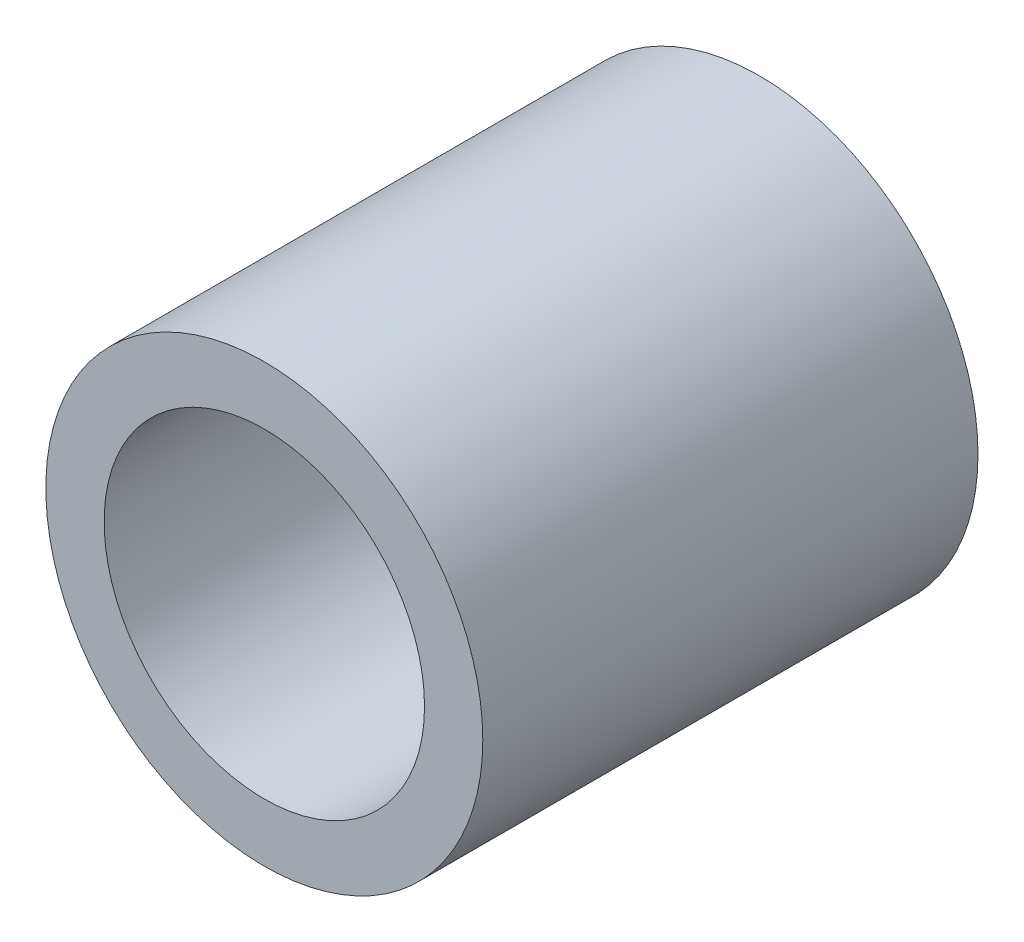
ISO-10303-21;
HEADER;
FILE_DESCRIPTION(('STEP AP214'),'2;1');
FILE_NAME('part.step','',(''),(''),'','','');
FILE_SCHEMA(('AUTOMOTIVE_DESIGN { 1 0 10303 214 1 1 1 1 }'));
ENDSEC;
DATA;
#1=APPLICATION_CONTEXT('core data for automotive mechanical design processes');
#2=APPLICATION_PROTOCOL_DEFINITION('international standard','automotive_design',2000,#1);
#3=PRODUCT_CONTEXT('',#1,'mechanical');
#4=PRODUCT('Part','Part','',(#3));
#5=PRODUCT_RELATED_PRODUCT_CATEGORY('part','',(#4));
#6=PRODUCT_DEFINITION_FORMATION('','',#4);
#7=PRODUCT_DEFINITION_CONTEXT('part definition',#1,'design');
#8=PRODUCT_DEFINITION('design','',#6,#7);
#9=PRODUCT_DEFINITION_SHAPE('','',#8);
#10=(LENGTH_UNIT() NAMED_UNIT(*) SI_UNIT(.MILLI.,.METRE.));
#11=(NAMED_UNIT(*) PLANE_ANGLE_UNIT() SI_UNIT($,.RADIAN.));
#12=(NAMED_UNIT(*) SI_UNIT($,.STERADIAN.) SOLID_ANGLE_UNIT());
#13=UNCERTAINTY_MEASURE_WITH_UNIT(LENGTH_MEASURE(1.E-05),#10,'distance_accuracy_value','');
#14=(GEOMETRIC_REPRESENTATION_CONTEXT(3) GLOBAL_UNCERTAINTY_ASSIGNED_CONTEXT((#13)) GLOBAL_UNIT_ASSIGNED_CONTEXT((#10,
#11,#12)) REPRESENTATION_CONTEXT('',''));
#15=CARTESIAN_POINT('',(0.,0.,0.));
#16=DIRECTION('',(0.,0.,1.));
#17=DIRECTION('',(1.,0.,0.));
#18=AXIS2_PLACEMENT_3D('',#15,#16,#17);
#19=CARTESIAN_POINT('',(0.,0.,34.544));
#20=DIRECTION('',(0.,0.,1.));
#21=DIRECTION('',(1.,0.,0.));
#22=AXIS2_PLACEMENT_3D('',#19,#20,#21);
#23=PLANE('',#22);
#24=CARTESIAN_POINT('',(0.,0.,34.544));
#25=DIRECTION('',(0.,0.,1.));
#26=DIRECTION('',(1.,0.,0.));
#27=AXIS2_PLACEMENT_3D('',#24,#25,#26);
#28=CIRCLE('',#27,15.24);
#29=CARTESIAN_POINT('',(15.24,0.,34.544));
#30=VERTEX_POINT('',#29);
#31=EDGE_CURVE('E10',#30,#30,#28,.T.);
#32=ORIENTED_EDGE('',*,*,#31,.T.);
#33=EDGE_LOOP('',(#32));
#34=FACE_BOUND('',#33,.T.);
#35=CARTESIAN_POINT('',(0.,0.,34.544));
#36=DIRECTION('',(0.,0.,1.));
#37=DIRECTION('',(1.,0.,0.));
#38=AXIS2_PLACEMENT_3D('',#35,#36,#37);
#39=CIRCLE('',#38,11.176);
#40=CARTESIAN_POINT('',(11.176,0.,34.544));
#41=VERTEX_POINT('',#40);
#42=EDGE_CURVE('E42',#41,#41,#39,.T.);
#43=ORIENTED_EDGE('',*,*,#42,.F.);
#44=EDGE_LOOP('',(#43));
#45=FACE_BOUND('',#44,.T.);
#46=ADVANCED_FACE('F31',(#34,#45),#23,.T.);
#47=CARTESIAN_POINT('',(0.,0.,0.));
#48=DIRECTION('',(0.,0.,1.));
#49=DIRECTION('',(1.,0.,0.));
#50=AXIS2_PLACEMENT_3D('',#47,#48,#49);
#51=PLANE('',#50);
#52=CARTESIAN_POINT('',(0.,0.,0.));
#53=DIRECTION('',(0.,0.,1.));
#54=DIRECTION('',(1.,0.,0.));
#55=AXIS2_PLACEMENT_3D('',#52,#53,#54);
#56=CIRCLE('',#55,15.24);
#57=CARTESIAN_POINT('',(15.24,0.,0.));
#58=VERTEX_POINT('',#57);
#59=EDGE_CURVE('E35',#58,#58,#56,.T.);
#60=ORIENTED_EDGE('',*,*,#59,.F.);
#61=EDGE_LOOP('',(#60));
#62=FACE_BOUND('',#61,.T.);
#63=CARTESIAN_POINT('',(0.,0.,0.));
#64=DIRECTION('',(0.,0.,1.));
#65=DIRECTION('',(1.,0.,0.));
#66=AXIS2_PLACEMENT_3D('',#63,#64,#65);
#67=CIRCLE('',#66,11.176);
#68=CARTESIAN_POINT('',(11.176,0.,0.));
#69=VERTEX_POINT('',#68);
#70=EDGE_CURVE('E44',#69,#69,#67,.T.);
#71=ORIENTED_EDGE('',*,*,#70,.T.);
#72=EDGE_LOOP('',(#71));
#73=FACE_BOUND('',#72,.T.);
#74=ADVANCED_FACE('F54',(#62,#73),#51,.F.);
#75=CARTESIAN_POINT('',(0.,0.,34.544));
#76=DIRECTION('',(0.,0.,-1.));
#77=DIRECTION('',(-1.,0.,0.));
#78=AXIS2_PLACEMENT_3D('',#75,#76,#77);
#79=CYLINDRICAL_SURFACE('',#78,15.24);
#80=ORIENTED_EDGE('',*,*,#31,.F.);
#81=EDGE_LOOP('',(#80));
#82=FACE_BOUND('',#81,.T.);
#83=ORIENTED_EDGE('',*,*,#59,.T.);
#84=EDGE_LOOP('',(#83));
#85=FACE_BOUND('',#84,.T.);
#86=ADVANCED_FACE('F33',(#82,#85),#79,.T.);
#87=CARTESIAN_POINT('',(0.,0.,34.544));
#88=DIRECTION('',(0.,0.,-1.));
#89=DIRECTION('',(-1.,0.,0.));
#90=AXIS2_PLACEMENT_3D('',#87,#88,#89);
#91=CYLINDRICAL_SURFACE('',#90,11.176);
#92=ORIENTED_EDGE('',*,*,#42,.T.);
#93=EDGE_LOOP('',(#92));
#94=FACE_BOUND('',#93,.T.);
#95=ORIENTED_EDGE('',*,*,#70,.F.);
#96=EDGE_LOOP('',(#95));
#97=FACE_BOUND('',#96,.T.);
#98=ADVANCED_FACE('F50',(#94,#97),#91,.F.);
#99=CLOSED_SHELL('',(#46,#74,#86,#98));
#100=MANIFOLD_SOLID_BREP('B2',#99);
#101=ADVANCED_BREP_SHAPE_REPRESENTATION('',(#18,#100),#14);
#102=SHAPE_DEFINITION_REPRESENTATION(#9,#101);
ENDSEC;
END-ISO-10303-21;
